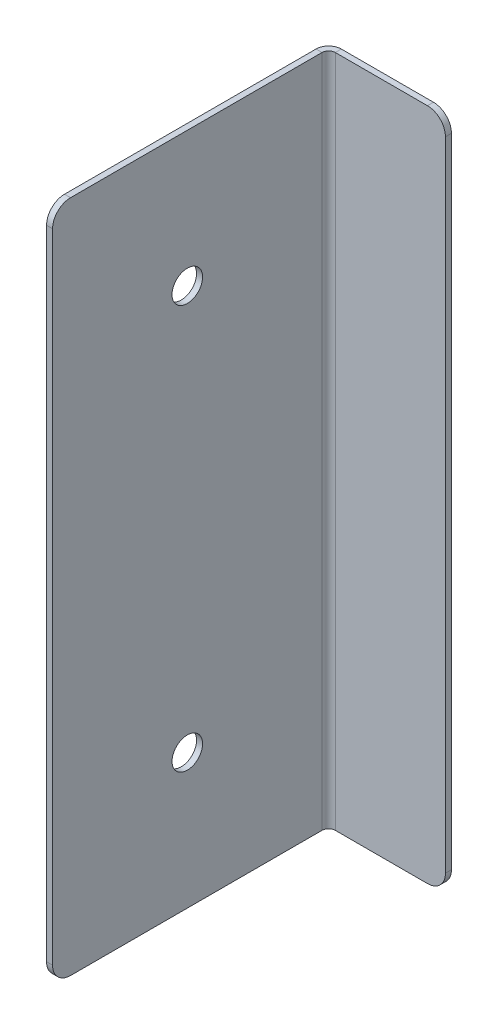
ISO-10303-21;
HEADER;
FILE_DESCRIPTION(('STEP AP214'),'2;1');
FILE_NAME('part.step','',(''),(''),'','','');
FILE_SCHEMA(('AUTOMOTIVE_DESIGN { 1 0 10303 214 1 1 1 1 }'));
ENDSEC;
DATA;
#1=APPLICATION_CONTEXT('core data for automotive mechanical design processes');
#2=APPLICATION_PROTOCOL_DEFINITION('international standard','automotive_design',2000,#1);
#3=PRODUCT_CONTEXT('',#1,'mechanical');
#4=PRODUCT('Part','Part','',(#3));
#5=PRODUCT_RELATED_PRODUCT_CATEGORY('part','',(#4));
#6=PRODUCT_DEFINITION_FORMATION('','',#4);
#7=PRODUCT_DEFINITION_CONTEXT('part definition',#1,'design');
#8=PRODUCT_DEFINITION('design','',#6,#7);
#9=PRODUCT_DEFINITION_SHAPE('','',#8);
#10=(LENGTH_UNIT() NAMED_UNIT(*) SI_UNIT(.MILLI.,.METRE.));
#11=(NAMED_UNIT(*) PLANE_ANGLE_UNIT() SI_UNIT($,.RADIAN.));
#12=(NAMED_UNIT(*) SI_UNIT($,.STERADIAN.) SOLID_ANGLE_UNIT());
#13=UNCERTAINTY_MEASURE_WITH_UNIT(LENGTH_MEASURE(1.E-05),#10,'distance_accuracy_value','');
#14=(GEOMETRIC_REPRESENTATION_CONTEXT(3) GLOBAL_UNCERTAINTY_ASSIGNED_CONTEXT((#13)) GLOBAL_UNIT_ASSIGNED_CONTEXT((#10,
#11,#12)) REPRESENTATION_CONTEXT('',''));
#15=CARTESIAN_POINT('',(0.,0.,0.));
#16=DIRECTION('',(0.,0.,1.));
#17=DIRECTION('',(1.,0.,0.));
#18=AXIS2_PLACEMENT_3D('',#15,#16,#17);
#19=CARTESIAN_POINT('',(-0.67,0.,0.));
#20=DIRECTION('',(0.,0.,1.));
#21=DIRECTION('',(0.,-1.,0.));
#22=AXIS2_PLACEMENT_3D('',#19,#20,#21);
#23=PLANE('',#22);
#24=DIRECTION('',(0.,-1.,0.));
#25=VECTOR('',#24,1.);
#26=CARTESIAN_POINT('',(0.,0.,0.));
#27=LINE('',#26,#25);
#28=CARTESIAN_POINT('',(0.,-2.,0.));
#29=VERTEX_POINT('',#28);
#30=CARTESIAN_POINT('',(0.,-73.,0.));
#31=VERTEX_POINT('',#30);
#32=EDGE_CURVE('E195',#29,#31,#27,.T.);
#33=ORIENTED_EDGE('',*,*,#32,.F.);
#34=DIRECTION('',(1.,0.,0.));
#35=VECTOR('',#34,1.);
#36=CARTESIAN_POINT('',(-0.67,-2.,0.));
#37=LINE('',#36,#35);
#38=CARTESIAN_POINT('',(-0.67,-2.,0.));
#39=VERTEX_POINT('',#38);
#40=EDGE_CURVE('E233',#29,#39,#37,.F.);
#41=ORIENTED_EDGE('',*,*,#40,.T.);
#42=DIRECTION('',(0.,-1.,0.));
#43=VECTOR('',#42,1.);
#44=CARTESIAN_POINT('',(-0.67,0.,0.));
#45=LINE('',#44,#43);
#46=CARTESIAN_POINT('',(-0.67,-73.,0.));
#47=VERTEX_POINT('',#46);
#48=EDGE_CURVE('E200',#39,#47,#45,.T.);
#49=ORIENTED_EDGE('',*,*,#48,.T.);
#50=DIRECTION('',(1.,0.,0.));
#51=VECTOR('',#50,1.);
#52=CARTESIAN_POINT('',(-0.67,-73.,0.));
#53=LINE('',#52,#51);
#54=EDGE_CURVE('E230',#47,#31,#53,.T.);
#55=ORIENTED_EDGE('',*,*,#54,.T.);
#56=EDGE_LOOP('',(#33,#41,#49,#55));
#57=FACE_BOUND('',#56,.T.);
#58=ADVANCED_FACE('F56',(#57),#23,.T.);
#59=CARTESIAN_POINT('',(-0.67,0.,0.));
#60=DIRECTION('',(0.,1.,0.));
#61=DIRECTION('',(0.,0.,1.));
#62=AXIS2_PLACEMENT_3D('',#59,#60,#61);
#63=PLANE('',#62);
#64=DIRECTION('',(0.,0.,1.));
#65=VECTOR('',#64,1.);
#66=CARTESIAN_POINT('',(-0.67,0.,0.));
#67=LINE('',#66,#65);
#68=CARTESIAN_POINT('',(-0.670000000000007,0.,-30.));
#69=VERTEX_POINT('',#68);
#70=CARTESIAN_POINT('',(-0.67,0.,-2.));
#71=VERTEX_POINT('',#70);
#72=EDGE_CURVE('E207',#69,#71,#67,.T.);
#73=ORIENTED_EDGE('',*,*,#72,.T.);
#74=DIRECTION('',(1.,0.,0.));
#75=VECTOR('',#74,1.);
#76=CARTESIAN_POINT('',(-0.67,0.,-2.));
#77=LINE('',#76,#75);
#78=CARTESIAN_POINT('',(0.,0.,-2.));
#79=VERTEX_POINT('',#78);
#80=EDGE_CURVE('E221',#71,#79,#77,.T.);
#81=ORIENTED_EDGE('',*,*,#80,.T.);
#82=DIRECTION('',(0.,0.,1.));
#83=VECTOR('',#82,1.);
#84=CARTESIAN_POINT('',(0.,0.,0.));
#85=LINE('',#84,#83);
#86=CARTESIAN_POINT('',(0.,0.,-30.));
#87=VERTEX_POINT('',#86);
#88=EDGE_CURVE('E204',#87,#79,#85,.T.);
#89=ORIENTED_EDGE('',*,*,#88,.F.);
#90=DIRECTION('',(1.,0.,0.));
#91=VECTOR('',#90,1.);
#92=CARTESIAN_POINT('',(-0.67,0.,-30.));
#93=LINE('',#92,#91);
#94=EDGE_CURVE('E219',#69,#87,#93,.T.);
#95=ORIENTED_EDGE('',*,*,#94,.F.);
#96=EDGE_LOOP('',(#73,#81,#89,#95));
#97=FACE_BOUND('',#96,.T.);
#98=ADVANCED_FACE('F283',(#97),#63,.T.);
#99=CARTESIAN_POINT('',(-0.67,-75.,0.));
#100=DIRECTION('',(0.,-1.,0.));
#101=DIRECTION('',(0.,0.,-1.));
#102=AXIS2_PLACEMENT_3D('',#99,#100,#101);
#103=PLANE('',#102);
#104=DIRECTION('',(0.,0.,-1.));
#105=VECTOR('',#104,1.);
#106=CARTESIAN_POINT('',(0.,-75.,0.));
#107=LINE('',#106,#105);
#108=CARTESIAN_POINT('',(0.,-75.,-2.00000000000001));
#109=VERTEX_POINT('',#108);
#110=CARTESIAN_POINT('',(0.,-75.,-30.));
#111=VERTEX_POINT('',#110);
#112=EDGE_CURVE('E213',#109,#111,#107,.T.);
#113=ORIENTED_EDGE('',*,*,#112,.F.);
#114=DIRECTION('',(1.,0.,0.));
#115=VECTOR('',#114,1.);
#116=CARTESIAN_POINT('',(-0.67,-75.,-2.00000000000001));
#117=LINE('',#116,#115);
#118=CARTESIAN_POINT('',(-0.67,-75.,-2.00000000000001));
#119=VERTEX_POINT('',#118);
#120=EDGE_CURVE('E13',#109,#119,#117,.F.);
#121=ORIENTED_EDGE('',*,*,#120,.T.);
#122=DIRECTION('',(0.,0.,-1.));
#123=VECTOR('',#122,1.);
#124=CARTESIAN_POINT('',(-0.67,-75.,0.));
#125=LINE('',#124,#123);
#126=CARTESIAN_POINT('',(-0.67,-75.,-30.));
#127=VERTEX_POINT('',#126);
#128=EDGE_CURVE('E203',#119,#127,#125,.T.);
#129=ORIENTED_EDGE('',*,*,#128,.T.);
#130=DIRECTION('',(1.,0.,0.));
#131=VECTOR('',#130,1.);
#132=CARTESIAN_POINT('',(-0.67,-75.,-30.));
#133=LINE('',#132,#131);
#134=EDGE_CURVE('E210',#127,#111,#133,.T.);
#135=ORIENTED_EDGE('',*,*,#134,.T.);
#136=EDGE_LOOP('',(#113,#121,#129,#135));
#137=FACE_BOUND('',#136,.T.);
#138=ADVANCED_FACE('F271',(#137),#103,.T.);
#139=CARTESIAN_POINT('',(-0.67,0.,0.));
#140=DIRECTION('',(1.,0.,0.));
#141=DIRECTION('',(0.,0.,-1.));
#142=AXIS2_PLACEMENT_3D('',#139,#140,#141);
#143=PLANE('',#142);
#144=CARTESIAN_POINT('',(-0.67,-15.,-15.));
#145=DIRECTION('',(1.,0.,0.));
#146=DIRECTION('',(0.,0.,-1.));
#147=AXIS2_PLACEMENT_3D('',#144,#145,#146);
#148=CIRCLE('',#147,1.7);
#149=CARTESIAN_POINT('',(-0.67,-15.,-16.7));
#150=VERTEX_POINT('',#149);
#151=EDGE_CURVE('E353',#150,#150,#148,.T.);
#152=ORIENTED_EDGE('',*,*,#151,.T.);
#153=EDGE_LOOP('',(#152));
#154=FACE_BOUND('',#153,.T.);
#155=CARTESIAN_POINT('',(-0.67,-60.,-15.));
#156=DIRECTION('',(1.,0.,0.));
#157=DIRECTION('',(0.,0.,-1.));
#158=AXIS2_PLACEMENT_3D('',#155,#156,#157);
#159=CIRCLE('',#158,1.69999999999999);
#160=CARTESIAN_POINT('',(-0.67,-60.,-16.7));
#161=VERTEX_POINT('',#160);
#162=EDGE_CURVE('E194',#161,#161,#159,.T.);
#163=ORIENTED_EDGE('',*,*,#162,.T.);
#164=EDGE_LOOP('',(#163));
#165=FACE_BOUND('',#164,.T.);
#166=ORIENTED_EDGE('',*,*,#48,.F.);
#167=CARTESIAN_POINT('',(-0.67,-2.,-2.));
#168=DIRECTION('',(1.,0.,0.));
#169=DIRECTION('',(0.,0.,-1.));
#170=AXIS2_PLACEMENT_3D('',#167,#168,#169);
#171=CIRCLE('',#170,2.);
#172=EDGE_CURVE('E237',#39,#71,#171,.F.);
#173=ORIENTED_EDGE('',*,*,#172,.T.);
#174=ORIENTED_EDGE('',*,*,#72,.F.);
#175=DIRECTION('',(0.,1.,0.));
#176=VECTOR('',#175,1.);
#177=CARTESIAN_POINT('',(-0.67,0.,-30.));
#178=LINE('',#177,#176);
#179=EDGE_CURVE('E156',#127,#69,#178,.T.);
#180=ORIENTED_EDGE('',*,*,#179,.F.);
#181=ORIENTED_EDGE('',*,*,#128,.F.);
#182=CARTESIAN_POINT('',(-0.67,-73.,-2.00000000000001));
#183=DIRECTION('',(1.,0.,0.));
#184=DIRECTION('',(0.,0.,-1.));
#185=AXIS2_PLACEMENT_3D('',#182,#183,#184);
#186=CIRCLE('',#185,2.);
#187=EDGE_CURVE('E235',#119,#47,#186,.F.);
#188=ORIENTED_EDGE('',*,*,#187,.T.);
#189=EDGE_LOOP('',(#166,#173,#174,#180,#181,#188));
#190=FACE_BOUND('',#189,.T.);
#191=ADVANCED_FACE('F277',(#154,#165,#190),#143,.F.);
#192=CARTESIAN_POINT('',(0.,0.,0.));
#193=DIRECTION('',(1.,0.,0.));
#194=DIRECTION('',(0.,0.,-1.));
#195=AXIS2_PLACEMENT_3D('',#192,#193,#194);
#196=PLANE('',#195);
#197=CARTESIAN_POINT('',(0.,-15.,-15.));
#198=DIRECTION('',(1.,0.,0.));
#199=DIRECTION('',(0.,0.,-1.));
#200=AXIS2_PLACEMENT_3D('',#197,#198,#199);
#201=CIRCLE('',#200,1.7);
#202=CARTESIAN_POINT('',(0.,-15.,-16.7));
#203=VERTEX_POINT('',#202);
#204=EDGE_CURVE('E358',#203,#203,#201,.T.);
#205=ORIENTED_EDGE('',*,*,#204,.F.);
#206=EDGE_LOOP('',(#205));
#207=FACE_BOUND('',#206,.T.);
#208=CARTESIAN_POINT('',(0.,-60.,-15.));
#209=DIRECTION('',(1.,0.,0.));
#210=DIRECTION('',(0.,0.,-1.));
#211=AXIS2_PLACEMENT_3D('',#208,#209,#210);
#212=CIRCLE('',#211,1.69999999999999);
#213=CARTESIAN_POINT('',(0.,-60.,-16.7));
#214=VERTEX_POINT('',#213);
#215=EDGE_CURVE('E349',#214,#214,#212,.T.);
#216=ORIENTED_EDGE('',*,*,#215,.F.);
#217=EDGE_LOOP('',(#216));
#218=FACE_BOUND('',#217,.T.);
#219=ORIENTED_EDGE('',*,*,#88,.T.);
#220=CARTESIAN_POINT('',(0.,-2.,-2.));
#221=DIRECTION('',(1.,0.,0.));
#222=DIRECTION('',(0.,0.,-1.));
#223=AXIS2_PLACEMENT_3D('',#220,#221,#222);
#224=CIRCLE('',#223,2.);
#225=EDGE_CURVE('E228',#79,#29,#224,.T.);
#226=ORIENTED_EDGE('',*,*,#225,.T.);
#227=ORIENTED_EDGE('',*,*,#32,.T.);
#228=CARTESIAN_POINT('',(0.,-73.,-2.00000000000001));
#229=DIRECTION('',(1.,0.,0.));
#230=DIRECTION('',(0.,0.,-1.));
#231=AXIS2_PLACEMENT_3D('',#228,#229,#230);
#232=CIRCLE('',#231,2.);
#233=EDGE_CURVE('E226',#31,#109,#232,.T.);
#234=ORIENTED_EDGE('',*,*,#233,.T.);
#235=ORIENTED_EDGE('',*,*,#112,.T.);
#236=DIRECTION('',(0.,1.,0.));
#237=VECTOR('',#236,1.);
#238=CARTESIAN_POINT('',(0.,0.,-30.));
#239=LINE('',#238,#237);
#240=EDGE_CURVE('E215',#111,#87,#239,.T.);
#241=ORIENTED_EDGE('',*,*,#240,.T.);
#242=EDGE_LOOP('',(#219,#226,#227,#234,#235,#241));
#243=FACE_BOUND('',#242,.T.);
#244=ADVANCED_FACE('F285',(#207,#218,#243),#196,.T.);
#245=CARTESIAN_POINT('',(0.736599999999997,-75.,-30.));
#246=DIRECTION('',(0.,-1.,0.));
#247=DIRECTION('',(0.,0.,-1.));
#248=AXIS2_PLACEMENT_3D('',#245,#246,#247);
#249=PLANE('',#248);
#250=DIRECTION('',(0.,0.,1.));
#251=VECTOR('',#250,1.);
#252=CARTESIAN_POINT('',(0.736599999999997,-75.,-31.4066));
#253=LINE('',#252,#251);
#254=CARTESIAN_POINT('',(0.736599999999994,-75.,-30.7366));
#255=VERTEX_POINT('',#254);
#256=CARTESIAN_POINT('',(0.736599999999992,-75.,-31.4066));
#257=VERTEX_POINT('',#256);
#258=EDGE_CURVE('E191',#255,#257,#253,.F.);
#259=ORIENTED_EDGE('',*,*,#258,.F.);
#260=CARTESIAN_POINT('',(0.736599999999997,-75.,-30.));
#261=DIRECTION('',(0.,1.,0.));
#262=DIRECTION('',(0.,0.,1.));
#263=AXIS2_PLACEMENT_3D('',#260,#261,#262);
#264=CIRCLE('',#263,0.736600000000004);
#265=EDGE_CURVE('E160',#111,#255,#264,.F.);
#266=ORIENTED_EDGE('',*,*,#265,.F.);
#267=ORIENTED_EDGE('',*,*,#134,.F.);
#268=CARTESIAN_POINT('',(0.736599999999997,-75.,-30.));
#269=DIRECTION('',(0.,1.,0.));
#270=DIRECTION('',(0.,0.,1.));
#271=AXIS2_PLACEMENT_3D('',#268,#269,#270);
#272=CIRCLE('',#271,1.4066);
#273=EDGE_CURVE('E159',#127,#257,#272,.F.);
#274=ORIENTED_EDGE('',*,*,#273,.T.);
#275=EDGE_LOOP('',(#259,#266,#267,#274));
#276=FACE_BOUND('',#275,.T.);
#277=ADVANCED_FACE('F268',(#276),#249,.T.);
#278=CARTESIAN_POINT('',(0.736599999999997,0.,-30.));
#279=DIRECTION('',(0.,-1.,0.));
#280=DIRECTION('',(0.,0.,-1.));
#281=AXIS2_PLACEMENT_3D('',#278,#279,#280);
#282=PLANE('',#281);
#283=CARTESIAN_POINT('',(0.736599999999997,0.,-30.));
#284=DIRECTION('',(0.,1.,0.));
#285=DIRECTION('',(0.,0.,1.));
#286=AXIS2_PLACEMENT_3D('',#283,#284,#285);
#287=CIRCLE('',#286,0.736600000000004);
#288=CARTESIAN_POINT('',(0.736599999999994,0.,-30.7366));
#289=VERTEX_POINT('',#288);
#290=EDGE_CURVE('E167',#289,#87,#287,.T.);
#291=ORIENTED_EDGE('',*,*,#290,.F.);
#292=DIRECTION('',(0.,0.,1.));
#293=VECTOR('',#292,1.);
#294=CARTESIAN_POINT('',(0.736599999999997,0.,-30.7366));
#295=LINE('',#294,#293);
#296=CARTESIAN_POINT('',(0.736599999999997,0.,-31.4066));
#297=VERTEX_POINT('',#296);
#298=EDGE_CURVE('E164',#289,#297,#295,.F.);
#299=ORIENTED_EDGE('',*,*,#298,.T.);
#300=CARTESIAN_POINT('',(0.736599999999997,0.,-30.));
#301=DIRECTION('',(0.,1.,0.));
#302=DIRECTION('',(0.,0.,1.));
#303=AXIS2_PLACEMENT_3D('',#300,#301,#302);
#304=CIRCLE('',#303,1.4066);
#305=EDGE_CURVE('E148',#297,#69,#304,.T.);
#306=ORIENTED_EDGE('',*,*,#305,.T.);
#307=ORIENTED_EDGE('',*,*,#94,.T.);
#308=EDGE_LOOP('',(#291,#299,#306,#307));
#309=FACE_BOUND('',#308,.T.);
#310=ADVANCED_FACE('F165',(#309),#282,.F.);
#311=CARTESIAN_POINT('',(0.736599999999997,0.,-30.));
#312=DIRECTION('',(0.,1.,0.));
#313=DIRECTION('',(0.,0.,-1.));
#314=AXIS2_PLACEMENT_3D('',#311,#312,#313);
#315=CYLINDRICAL_SURFACE('',#314,1.4066);
#316=ORIENTED_EDGE('',*,*,#179,.T.);
#317=ORIENTED_EDGE('',*,*,#305,.F.);
#318=DIRECTION('',(0.,1.,0.));
#319=VECTOR('',#318,1.);
#320=CARTESIAN_POINT('',(0.736599999999997,-75.,-31.4066));
#321=LINE('',#320,#319);
#322=EDGE_CURVE('E153',#297,#257,#321,.F.);
#323=ORIENTED_EDGE('',*,*,#322,.T.);
#324=ORIENTED_EDGE('',*,*,#273,.F.);
#325=EDGE_LOOP('',(#316,#317,#323,#324));
#326=FACE_BOUND('',#325,.T.);
#327=ADVANCED_FACE('F150',(#326),#315,.T.);
#328=CARTESIAN_POINT('',(0.736599999999997,0.,-30.));
#329=DIRECTION('',(0.,1.,0.));
#330=DIRECTION('',(0.,0.,-1.));
#331=AXIS2_PLACEMENT_3D('',#328,#329,#330);
#332=CYLINDRICAL_SURFACE('',#331,0.736600000000004);
#333=ORIENTED_EDGE('',*,*,#240,.F.);
#334=ORIENTED_EDGE('',*,*,#265,.T.);
#335=DIRECTION('',(0.,1.,0.));
#336=VECTOR('',#335,1.);
#337=CARTESIAN_POINT('',(0.736599999999997,-75.,-30.7366));
#338=LINE('',#337,#336);
#339=EDGE_CURVE('E169',#255,#289,#338,.T.);
#340=ORIENTED_EDGE('',*,*,#339,.T.);
#341=ORIENTED_EDGE('',*,*,#290,.T.);
#342=EDGE_LOOP('',(#333,#334,#340,#341));
#343=FACE_BOUND('',#342,.T.);
#344=ADVANCED_FACE('F264',(#343),#332,.F.);
#345=CARTESIAN_POINT('',(0.,-75.,-31.4066));
#346=DIRECTION('',(0.,1.,0.));
#347=DIRECTION('',(0.,0.,1.));
#348=AXIS2_PLACEMENT_3D('',#345,#346,#347);
#349=PLANE('',#348);
#350=DIRECTION('',(-1.,0.,0.));
#351=VECTOR('',#350,1.);
#352=CARTESIAN_POINT('',(-1.06422701055633E-13,-75.,-31.4066));
#353=LINE('',#352,#351);
#354=CARTESIAN_POINT('',(11.,-75.,-31.4066));
#355=VERTEX_POINT('',#354);
#356=EDGE_CURVE('E174',#355,#257,#353,.T.);
#357=ORIENTED_EDGE('',*,*,#356,.F.);
#358=DIRECTION('',(0.,0.,1.));
#359=VECTOR('',#358,1.);
#360=CARTESIAN_POINT('',(11.,-75.,-31.4066));
#361=LINE('',#360,#359);
#362=CARTESIAN_POINT('',(11.,-75.,-30.7366));
#363=VERTEX_POINT('',#362);
#364=EDGE_CURVE('E64',#355,#363,#361,.T.);
#365=ORIENTED_EDGE('',*,*,#364,.T.);
#366=DIRECTION('',(1.,0.,0.));
#367=VECTOR('',#366,1.);
#368=CARTESIAN_POINT('',(0.,-75.,-30.7366));
#369=LINE('',#368,#367);
#370=EDGE_CURVE('E175',#363,#255,#369,.F.);
#371=ORIENTED_EDGE('',*,*,#370,.T.);
#372=ORIENTED_EDGE('',*,*,#258,.T.);
#373=EDGE_LOOP('',(#357,#365,#371,#372));
#374=FACE_BOUND('',#373,.T.);
#375=ADVANCED_FACE('F255',(#374),#349,.F.);
#376=CARTESIAN_POINT('',(13.,0.,-31.4066));
#377=DIRECTION('',(0.,-1.,0.));
#378=DIRECTION('',(0.,0.,-1.));
#379=AXIS2_PLACEMENT_3D('',#376,#377,#378);
#380=PLANE('',#379);
#381=DIRECTION('',(-1.,0.,0.));
#382=VECTOR('',#381,1.);
#383=CARTESIAN_POINT('',(13.,0.,-30.7366));
#384=LINE('',#383,#382);
#385=CARTESIAN_POINT('',(11.,0.,-30.7366));
#386=VERTEX_POINT('',#385);
#387=EDGE_CURVE('E187',#289,#386,#384,.F.);
#388=ORIENTED_EDGE('',*,*,#387,.T.);
#389=DIRECTION('',(0.,0.,1.));
#390=VECTOR('',#389,1.);
#391=CARTESIAN_POINT('',(11.,0.,-31.4066));
#392=LINE('',#391,#390);
#393=CARTESIAN_POINT('',(11.,0.,-31.4066));
#394=VERTEX_POINT('',#393);
#395=EDGE_CURVE('E79',#386,#394,#392,.F.);
#396=ORIENTED_EDGE('',*,*,#395,.T.);
#397=DIRECTION('',(1.,0.,0.));
#398=VECTOR('',#397,1.);
#399=CARTESIAN_POINT('',(-1.06422701055633E-13,0.,-31.4066));
#400=LINE('',#399,#398);
#401=EDGE_CURVE('E172',#297,#394,#400,.T.);
#402=ORIENTED_EDGE('',*,*,#401,.F.);
#403=ORIENTED_EDGE('',*,*,#298,.F.);
#404=EDGE_LOOP('',(#388,#396,#402,#403));
#405=FACE_BOUND('',#404,.T.);
#406=ADVANCED_FACE('F177',(#405),#380,.F.);
#407=CARTESIAN_POINT('',(-1.06422701055633E-13,0.,-31.4066));
#408=DIRECTION('',(0.,0.,1.));
#409=DIRECTION('',(1.,0.,0.));
#410=AXIS2_PLACEMENT_3D('',#407,#408,#409);
#411=PLANE('',#410);
#412=ORIENTED_EDGE('',*,*,#401,.T.);
#413=CARTESIAN_POINT('',(11.,-2.,-31.4066));
#414=DIRECTION('',(0.,0.,1.));
#415=DIRECTION('',(1.,0.,0.));
#416=AXIS2_PLACEMENT_3D('',#413,#414,#415);
#417=CIRCLE('',#416,2.);
#418=CARTESIAN_POINT('',(13.,-2.,-31.4066));
#419=VERTEX_POINT('',#418);
#420=EDGE_CURVE('E250',#394,#419,#417,.F.);
#421=ORIENTED_EDGE('',*,*,#420,.T.);
#422=DIRECTION('',(0.,-1.,0.));
#423=VECTOR('',#422,1.);
#424=CARTESIAN_POINT('',(13.,0.,-31.4066));
#425=LINE('',#424,#423);
#426=CARTESIAN_POINT('',(13.,-73.,-31.4066000000001));
#427=VERTEX_POINT('',#426);
#428=EDGE_CURVE('E178',#419,#427,#425,.T.);
#429=ORIENTED_EDGE('',*,*,#428,.T.);
#430=CARTESIAN_POINT('',(11.,-73.,-31.4066));
#431=DIRECTION('',(0.,0.,1.));
#432=DIRECTION('',(1.,0.,0.));
#433=AXIS2_PLACEMENT_3D('',#430,#431,#432);
#434=CIRCLE('',#433,2.);
#435=EDGE_CURVE('E71',#427,#355,#434,.F.);
#436=ORIENTED_EDGE('',*,*,#435,.T.);
#437=ORIENTED_EDGE('',*,*,#356,.T.);
#438=ORIENTED_EDGE('',*,*,#322,.F.);
#439=EDGE_LOOP('',(#412,#421,#429,#436,#437,#438));
#440=FACE_BOUND('',#439,.T.);
#441=ADVANCED_FACE('F171',(#440),#411,.F.);
#442=CARTESIAN_POINT('',(-1.04083408558608E-13,0.,-30.7366));
#443=DIRECTION('',(0.,0.,1.));
#444=DIRECTION('',(1.,0.,0.));
#445=AXIS2_PLACEMENT_3D('',#442,#443,#444);
#446=PLANE('',#445);
#447=DIRECTION('',(0.,1.,0.));
#448=VECTOR('',#447,1.);
#449=CARTESIAN_POINT('',(13.,-75.,-30.7366000000001));
#450=LINE('',#449,#448);
#451=CARTESIAN_POINT('',(13.,-2.,-30.7366));
#452=VERTEX_POINT('',#451);
#453=CARTESIAN_POINT('',(13.,-73.,-30.7366000000001));
#454=VERTEX_POINT('',#453);
#455=EDGE_CURVE('E181',#452,#454,#450,.F.);
#456=ORIENTED_EDGE('',*,*,#455,.F.);
#457=CARTESIAN_POINT('',(11.,-2.,-30.7366));
#458=DIRECTION('',(0.,0.,1.));
#459=DIRECTION('',(1.,0.,0.));
#460=AXIS2_PLACEMENT_3D('',#457,#458,#459);
#461=CIRCLE('',#460,2.);
#462=EDGE_CURVE('E246',#452,#386,#461,.T.);
#463=ORIENTED_EDGE('',*,*,#462,.T.);
#464=ORIENTED_EDGE('',*,*,#387,.F.);
#465=ORIENTED_EDGE('',*,*,#339,.F.);
#466=ORIENTED_EDGE('',*,*,#370,.F.);
#467=CARTESIAN_POINT('',(11.,-73.,-30.7366));
#468=DIRECTION('',(0.,0.,1.));
#469=DIRECTION('',(1.,0.,0.));
#470=AXIS2_PLACEMENT_3D('',#467,#468,#469);
#471=CIRCLE('',#470,2.);
#472=EDGE_CURVE('E244',#363,#454,#471,.T.);
#473=ORIENTED_EDGE('',*,*,#472,.T.);
#474=EDGE_LOOP('',(#456,#463,#464,#465,#466,#473));
#475=FACE_BOUND('',#474,.T.);
#476=ADVANCED_FACE('F261',(#475),#446,.T.);
#477=CARTESIAN_POINT('',(13.,-75.,-31.4066000000001));
#478=DIRECTION('',(-1.,0.,0.));
#479=DIRECTION('',(0.,0.,1.));
#480=AXIS2_PLACEMENT_3D('',#477,#478,#479);
#481=PLANE('',#480);
#482=ORIENTED_EDGE('',*,*,#428,.F.);
#483=DIRECTION('',(0.,0.,1.));
#484=VECTOR('',#483,1.);
#485=CARTESIAN_POINT('',(13.,-2.,-31.4066));
#486=LINE('',#485,#484);
#487=EDGE_CURVE('E241',#419,#452,#486,.T.);
#488=ORIENTED_EDGE('',*,*,#487,.T.);
#489=ORIENTED_EDGE('',*,*,#455,.T.);
#490=DIRECTION('',(0.,0.,1.));
#491=VECTOR('',#490,1.);
#492=CARTESIAN_POINT('',(13.,-73.,-31.4066000000001));
#493=LINE('',#492,#491);
#494=EDGE_CURVE('E239',#454,#427,#493,.F.);
#495=ORIENTED_EDGE('',*,*,#494,.T.);
#496=EDGE_LOOP('',(#482,#488,#489,#495));
#497=FACE_BOUND('',#496,.T.);
#498=ADVANCED_FACE('F334',(#497),#481,.F.);
#499=CARTESIAN_POINT('',(-10.,-60.,-15.));
#500=DIRECTION('',(1.,0.,0.));
#501=DIRECTION('',(0.,0.,-1.));
#502=AXIS2_PLACEMENT_3D('',#499,#500,#501);
#503=CYLINDRICAL_SURFACE('',#502,1.69999999999999);
#504=ORIENTED_EDGE('',*,*,#215,.T.);
#505=EDGE_LOOP('',(#504));
#506=FACE_BOUND('',#505,.T.);
#507=ORIENTED_EDGE('',*,*,#162,.F.);
#508=EDGE_LOOP('',(#507));
#509=FACE_BOUND('',#508,.T.);
#510=ADVANCED_FACE('F304',(#506,#509),#503,.F.);
#511=CARTESIAN_POINT('',(-10.,-15.,-15.));
#512=DIRECTION('',(1.,0.,0.));
#513=DIRECTION('',(0.,0.,-1.));
#514=AXIS2_PLACEMENT_3D('',#511,#512,#513);
#515=CYLINDRICAL_SURFACE('',#514,1.7);
#516=ORIENTED_EDGE('',*,*,#204,.T.);
#517=EDGE_LOOP('',(#516));
#518=FACE_BOUND('',#517,.T.);
#519=ORIENTED_EDGE('',*,*,#151,.F.);
#520=EDGE_LOOP('',(#519));
#521=FACE_BOUND('',#520,.T.);
#522=ADVANCED_FACE('F295',(#518,#521),#515,.F.);
#523=CARTESIAN_POINT('',(-0.67,-2.,-2.));
#524=DIRECTION('',(1.,0.,0.));
#525=DIRECTION('',(0.,0.,-1.));
#526=AXIS2_PLACEMENT_3D('',#523,#524,#525);
#527=CYLINDRICAL_SURFACE('',#526,2.);
#528=ORIENTED_EDGE('',*,*,#172,.F.);
#529=ORIENTED_EDGE('',*,*,#40,.F.);
#530=ORIENTED_EDGE('',*,*,#225,.F.);
#531=ORIENTED_EDGE('',*,*,#80,.F.);
#532=EDGE_LOOP('',(#528,#529,#530,#531));
#533=FACE_BOUND('',#532,.T.);
#534=ADVANCED_FACE('F292',(#533),#527,.T.);
#535=CARTESIAN_POINT('',(11.,-2.,-31.4066));
#536=DIRECTION('',(0.,0.,1.));
#537=DIRECTION('',(1.,0.,0.));
#538=AXIS2_PLACEMENT_3D('',#535,#536,#537);
#539=CYLINDRICAL_SURFACE('',#538,2.);
#540=ORIENTED_EDGE('',*,*,#420,.F.);
#541=ORIENTED_EDGE('',*,*,#395,.F.);
#542=ORIENTED_EDGE('',*,*,#462,.F.);
#543=ORIENTED_EDGE('',*,*,#487,.F.);
#544=EDGE_LOOP('',(#540,#541,#542,#543));
#545=FACE_BOUND('',#544,.T.);
#546=ADVANCED_FACE('F294',(#545),#539,.T.);
#547=CARTESIAN_POINT('',(11.,-73.,-31.4066));
#548=DIRECTION('',(0.,0.,1.));
#549=DIRECTION('',(1.,0.,0.));
#550=AXIS2_PLACEMENT_3D('',#547,#548,#549);
#551=CYLINDRICAL_SURFACE('',#550,2.);
#552=ORIENTED_EDGE('',*,*,#435,.F.);
#553=ORIENTED_EDGE('',*,*,#494,.F.);
#554=ORIENTED_EDGE('',*,*,#472,.F.);
#555=ORIENTED_EDGE('',*,*,#364,.F.);
#556=EDGE_LOOP('',(#552,#553,#554,#555));
#557=FACE_BOUND('',#556,.T.);
#558=ADVANCED_FACE('F301',(#557),#551,.T.);
#559=CARTESIAN_POINT('',(-0.67,-73.,-2.00000000000001));
#560=DIRECTION('',(1.,0.,0.));
#561=DIRECTION('',(0.,0.,-1.));
#562=AXIS2_PLACEMENT_3D('',#559,#560,#561);
#563=CYLINDRICAL_SURFACE('',#562,2.);
#564=ORIENTED_EDGE('',*,*,#187,.F.);
#565=ORIENTED_EDGE('',*,*,#120,.F.);
#566=ORIENTED_EDGE('',*,*,#233,.F.);
#567=ORIENTED_EDGE('',*,*,#54,.F.);
#568=EDGE_LOOP('',(#564,#565,#566,#567));
#569=FACE_BOUND('',#568,.T.);
#570=ADVANCED_FACE('F58',(#569),#563,.T.);
#571=CLOSED_SHELL('',(#58,#98,#138,#191,#244,#277,#310,#327,#344,#375,#406,#441,#476,#498,#510,
#522,#534,#546,#558,#570));
#572=MANIFOLD_SOLID_BREP('B2',#571);
#573=ADVANCED_BREP_SHAPE_REPRESENTATION('',(#18,#572),#14);
#574=SHAPE_DEFINITION_REPRESENTATION(#9,#573);
ENDSEC;
END-ISO-10303-21;
